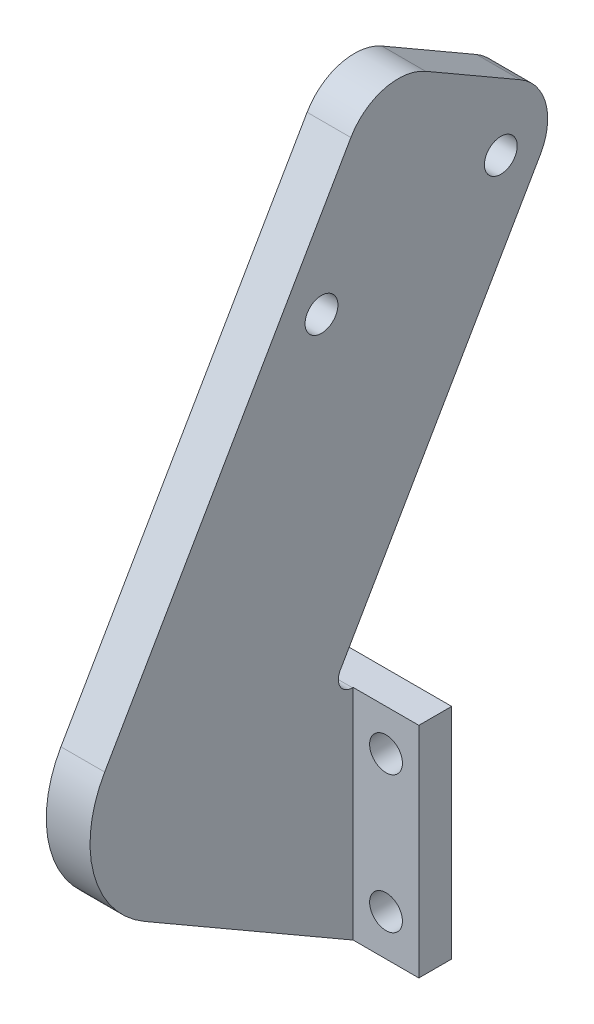
ISO-10303-21;
HEADER;
FILE_DESCRIPTION(('STEP AP214'),'2;1');
FILE_NAME('part.step','',(''),(''),'','','');
FILE_SCHEMA(('AUTOMOTIVE_DESIGN { 1 0 10303 214 1 1 1 1 }'));
ENDSEC;
DATA;
#1=APPLICATION_CONTEXT('core data for automotive mechanical design processes');
#2=APPLICATION_PROTOCOL_DEFINITION('international standard','automotive_design',2000,#1);
#3=PRODUCT_CONTEXT('',#1,'mechanical');
#4=PRODUCT('Part','Part','',(#3));
#5=PRODUCT_RELATED_PRODUCT_CATEGORY('part','',(#4));
#6=PRODUCT_DEFINITION_FORMATION('','',#4);
#7=PRODUCT_DEFINITION_CONTEXT('part definition',#1,'design');
#8=PRODUCT_DEFINITION('design','',#6,#7);
#9=PRODUCT_DEFINITION_SHAPE('','',#8);
#10=(LENGTH_UNIT() NAMED_UNIT(*) SI_UNIT(.MILLI.,.METRE.));
#11=(NAMED_UNIT(*) PLANE_ANGLE_UNIT() SI_UNIT($,.RADIAN.));
#12=(NAMED_UNIT(*) SI_UNIT($,.STERADIAN.) SOLID_ANGLE_UNIT());
#13=UNCERTAINTY_MEASURE_WITH_UNIT(LENGTH_MEASURE(1.E-05),#10,'distance_accuracy_value','');
#14=(GEOMETRIC_REPRESENTATION_CONTEXT(3) GLOBAL_UNCERTAINTY_ASSIGNED_CONTEXT((#13)) GLOBAL_UNIT_ASSIGNED_CONTEXT((#10,
#11,#12)) REPRESENTATION_CONTEXT('',''));
#15=CARTESIAN_POINT('',(0.,0.,0.));
#16=DIRECTION('',(0.,0.,1.));
#17=DIRECTION('',(1.,0.,0.));
#18=AXIS2_PLACEMENT_3D('',#15,#16,#17);
#19=CARTESIAN_POINT('',(0.,0.,0.));
#20=DIRECTION('',(0.,0.,-1.));
#21=DIRECTION('',(-1.,0.,0.));
#22=AXIS2_PLACEMENT_3D('',#19,#20,#21);
#23=PLANE('',#22);
#24=CARTESIAN_POINT('',(14.0000000000001,3.75,0.));
#25=DIRECTION('',(0.,0.,1.));
#26=DIRECTION('',(1.,0.,0.));
#27=AXIS2_PLACEMENT_3D('',#24,#25,#26);
#28=CIRCLE('',#27,1.5);
#29=CARTESIAN_POINT('',(15.5000000000001,3.75,0.));
#30=VERTEX_POINT('',#29);
#31=EDGE_CURVE('E149',#30,#30,#28,.T.);
#32=ORIENTED_EDGE('',*,*,#31,.T.);
#33=EDGE_LOOP('',(#32));
#34=FACE_BOUND('',#33,.T.);
#35=CARTESIAN_POINT('',(14.,16.25,0.));
#36=DIRECTION('',(0.,0.,1.));
#37=DIRECTION('',(1.,0.,0.));
#38=AXIS2_PLACEMENT_3D('',#35,#36,#37);
#39=CIRCLE('',#38,1.5);
#40=CARTESIAN_POINT('',(15.5,16.25,0.));
#41=VERTEX_POINT('',#40);
#42=EDGE_CURVE('E160',#41,#41,#39,.T.);
#43=ORIENTED_EDGE('',*,*,#42,.T.);
#44=EDGE_LOOP('',(#43));
#45=FACE_BOUND('',#44,.T.);
#46=DIRECTION('',(1.,0.,0.));
#47=VECTOR('',#46,1.);
#48=CARTESIAN_POINT('',(0.,0.,0.));
#49=LINE('',#48,#47);
#50=CARTESIAN_POINT('',(7.,0.,0.));
#51=VERTEX_POINT('',#50);
#52=CARTESIAN_POINT('',(17.,0.,0.));
#53=VERTEX_POINT('',#52);
#54=EDGE_CURVE('E165',#51,#53,#49,.T.);
#55=ORIENTED_EDGE('',*,*,#54,.F.);
#56=DIRECTION('',(0.,-1.,0.));
#57=VECTOR('',#56,1.);
#58=CARTESIAN_POINT('',(7.,20.,0.));
#59=LINE('',#58,#57);
#60=CARTESIAN_POINT('',(7.,20.,0.));
#61=VERTEX_POINT('',#60);
#62=EDGE_CURVE('E128',#61,#51,#59,.T.);
#63=ORIENTED_EDGE('',*,*,#62,.F.);
#64=DIRECTION('',(-1.,0.,0.));
#65=VECTOR('',#64,1.);
#66=CARTESIAN_POINT('',(0.,20.,0.));
#67=LINE('',#66,#65);
#68=CARTESIAN_POINT('',(17.,20.,0.));
#69=VERTEX_POINT('',#68);
#70=EDGE_CURVE('E170',#69,#61,#67,.T.);
#71=ORIENTED_EDGE('',*,*,#70,.F.);
#72=DIRECTION('',(0.,1.,0.));
#73=VECTOR('',#72,1.);
#74=CARTESIAN_POINT('',(17.,0.,0.));
#75=LINE('',#74,#73);
#76=EDGE_CURVE('E177',#53,#69,#75,.T.);
#77=ORIENTED_EDGE('',*,*,#76,.F.);
#78=EDGE_LOOP('',(#55,#63,#71,#77));
#79=FACE_BOUND('',#78,.T.);
#80=ADVANCED_FACE('F36',(#34,#45,#79),#23,.T.);
#81=CARTESIAN_POINT('',(0.,0.,3.));
#82=DIRECTION('',(0.,1.,0.));
#83=DIRECTION('',(0.,0.,1.));
#84=AXIS2_PLACEMENT_3D('',#81,#82,#83);
#85=PLANE('',#84);
#86=DIRECTION('',(0.,0.,1.));
#87=VECTOR('',#86,1.);
#88=CARTESIAN_POINT('',(7.,0.,0.));
#89=LINE('',#88,#87);
#90=CARTESIAN_POINT('',(7.,0.,3.));
#91=VERTEX_POINT('',#90);
#92=EDGE_CURVE('E125',#51,#91,#89,.T.);
#93=ORIENTED_EDGE('',*,*,#92,.F.);
#94=ORIENTED_EDGE('',*,*,#54,.T.);
#95=DIRECTION('',(0.,0.,-1.));
#96=VECTOR('',#95,1.);
#97=CARTESIAN_POINT('',(17.,0.,3.));
#98=LINE('',#97,#96);
#99=CARTESIAN_POINT('',(17.,0.,3.));
#100=VERTEX_POINT('',#99);
#101=EDGE_CURVE('E183',#100,#53,#98,.T.);
#102=ORIENTED_EDGE('',*,*,#101,.F.);
#103=DIRECTION('',(1.,0.,0.));
#104=VECTOR('',#103,1.);
#105=CARTESIAN_POINT('',(0.,0.,3.));
#106=LINE('',#105,#104);
#107=CARTESIAN_POINT('',(11.,0.,3.));
#108=VERTEX_POINT('',#107);
#109=EDGE_CURVE('E148',#108,#100,#106,.T.);
#110=ORIENTED_EDGE('',*,*,#109,.F.);
#111=DIRECTION('',(-1.,0.,0.));
#112=VECTOR('',#111,1.);
#113=CARTESIAN_POINT('',(11.,0.,3.));
#114=LINE('',#113,#112);
#115=EDGE_CURVE('E139',#108,#91,#114,.T.);
#116=ORIENTED_EDGE('',*,*,#115,.T.);
#117=EDGE_LOOP('',(#93,#94,#102,#110,#116));
#118=FACE_BOUND('',#117,.T.);
#119=ADVANCED_FACE('F146',(#118),#85,.F.);
#120=CARTESIAN_POINT('',(0.,20.,3.));
#121=DIRECTION('',(0.,-1.,0.));
#122=DIRECTION('',(0.,0.,-1.));
#123=AXIS2_PLACEMENT_3D('',#120,#121,#122);
#124=PLANE('',#123);
#125=DIRECTION('',(0.,0.,-1.));
#126=VECTOR('',#125,1.);
#127=CARTESIAN_POINT('',(7.,20.,3.05773502691893));
#128=LINE('',#127,#126);
#129=CARTESIAN_POINT('',(7.,20.,3.05773502691893));
#130=VERTEX_POINT('',#129);
#131=EDGE_CURVE('E228',#130,#61,#128,.T.);
#132=ORIENTED_EDGE('',*,*,#131,.F.);
#133=DIRECTION('',(-1.,0.,0.));
#134=VECTOR('',#133,1.);
#135=CARTESIAN_POINT('',(0.,20.,3.05773502691893));
#136=LINE('',#135,#134);
#137=CARTESIAN_POINT('',(11.,20.,3.05773502691893));
#138=VERTEX_POINT('',#137);
#139=EDGE_CURVE('E204',#130,#138,#136,.F.);
#140=ORIENTED_EDGE('',*,*,#139,.T.);
#141=DIRECTION('',(0.,0.,-1.));
#142=VECTOR('',#141,1.);
#143=CARTESIAN_POINT('',(11.,20.,3.));
#144=LINE('',#143,#142);
#145=CARTESIAN_POINT('',(11.,20.,3.));
#146=VERTEX_POINT('',#145);
#147=EDGE_CURVE('E150',#138,#146,#144,.T.);
#148=ORIENTED_EDGE('',*,*,#147,.T.);
#149=DIRECTION('',(-1.,0.,0.));
#150=VECTOR('',#149,1.);
#151=CARTESIAN_POINT('',(0.,20.,3.));
#152=LINE('',#151,#150);
#153=CARTESIAN_POINT('',(17.,20.,3.));
#154=VERTEX_POINT('',#153);
#155=EDGE_CURVE('E172',#154,#146,#152,.T.);
#156=ORIENTED_EDGE('',*,*,#155,.F.);
#157=DIRECTION('',(0.,0.,-1.));
#158=VECTOR('',#157,1.);
#159=CARTESIAN_POINT('',(17.,20.,3.));
#160=LINE('',#159,#158);
#161=EDGE_CURVE('E175',#154,#69,#160,.T.);
#162=ORIENTED_EDGE('',*,*,#161,.T.);
#163=ORIENTED_EDGE('',*,*,#70,.T.);
#164=EDGE_LOOP('',(#132,#140,#148,#156,#162,#163));
#165=FACE_BOUND('',#164,.T.);
#166=ADVANCED_FACE('F300',(#165),#124,.F.);
#167=CARTESIAN_POINT('',(11.,20.,5.30940107675847));
#168=DIRECTION('',(0.,-0.500000000000002,-0.866025403784438));
#169=DIRECTION('',(0.,0.866025403784438,-0.500000000000002));
#170=AXIS2_PLACEMENT_3D('',#167,#168,#169);
#171=PLANE('',#170);
#172=DIRECTION('',(-1.,0.,0.));
#173=VECTOR('',#172,1.);
#174=CARTESIAN_POINT('',(11.,21.95,4.1835680518387));
#175=LINE('',#174,#173);
#176=CARTESIAN_POINT('',(11.,21.95,4.1835680518387));
#177=VERTEX_POINT('',#176);
#178=CARTESIAN_POINT('',(7.,21.95,4.1835680518387));
#179=VERTEX_POINT('',#178);
#180=EDGE_CURVE('E201',#177,#179,#175,.T.);
#181=ORIENTED_EDGE('',*,*,#180,.T.);
#182=DIRECTION('',(0.,-0.866025403784438,0.500000000000001));
#183=VECTOR('',#182,1.);
#184=CARTESIAN_POINT('',(7.,53.6313972081441,-14.1076951545868));
#185=LINE('',#184,#183);
#186=CARTESIAN_POINT('',(7.,53.6313972081441,-14.1076951545868));
#187=VERTEX_POINT('',#186);
#188=EDGE_CURVE('E229',#187,#179,#185,.T.);
#189=ORIENTED_EDGE('',*,*,#188,.F.);
#190=DIRECTION('',(-1.,0.,0.));
#191=VECTOR('',#190,1.);
#192=CARTESIAN_POINT('',(11.,53.6313972081441,-14.1076951545868));
#193=LINE('',#192,#191);
#194=CARTESIAN_POINT('',(11.,53.6313972081441,-14.1076951545868));
#195=VERTEX_POINT('',#194);
#196=EDGE_CURVE('E199',#187,#195,#193,.F.);
#197=ORIENTED_EDGE('',*,*,#196,.T.);
#198=DIRECTION('',(0.,-0.866025403784438,0.500000000000002));
#199=VECTOR('',#198,1.);
#200=CARTESIAN_POINT('',(11.,20.,5.30940107675847));
#201=LINE('',#200,#199);
#202=EDGE_CURVE('E155',#195,#177,#201,.T.);
#203=ORIENTED_EDGE('',*,*,#202,.T.);
#204=EDGE_LOOP('',(#181,#189,#197,#203));
#205=FACE_BOUND('',#204,.T.);
#206=ADVANCED_FACE('F220',(#205),#171,.T.);
#207=CARTESIAN_POINT('',(11.,57.9615242270663,-16.6076951545868));
#208=DIRECTION('',(0.,0.866025403784438,-0.500000000000002));
#209=DIRECTION('',(0.,0.500000000000002,0.866025403784438));
#210=AXIS2_PLACEMENT_3D('',#207,#208,#209);
#211=PLANE('',#210);
#212=DIRECTION('',(-1.,0.,0.));
#213=VECTOR('',#212,1.);
#214=CARTESIAN_POINT('',(11.,60.4615242270663,-12.2775681356646));
#215=LINE('',#214,#213);
#216=CARTESIAN_POINT('',(11.,60.4615242270663,-12.2775681356646));
#217=VERTEX_POINT('',#216);
#218=CARTESIAN_POINT('',(7.,60.4615242270663,-12.2775681356646));
#219=VERTEX_POINT('',#218);
#220=EDGE_CURVE('E189',#217,#219,#215,.T.);
#221=ORIENTED_EDGE('',*,*,#220,.T.);
#222=DIRECTION('',(0.,-0.500000000000002,-0.866025403784438));
#223=VECTOR('',#222,1.);
#224=CARTESIAN_POINT('',(7.,65.4615242270663,-3.61731409782026));
#225=LINE('',#224,#223);
#226=CARTESIAN_POINT('',(7.,65.4615242270663,-3.61731409782026));
#227=VERTEX_POINT('',#226);
#228=EDGE_CURVE('E260',#227,#219,#225,.T.);
#229=ORIENTED_EDGE('',*,*,#228,.F.);
#230=DIRECTION('',(-1.,0.,0.));
#231=VECTOR('',#230,1.);
#232=CARTESIAN_POINT('',(11.,65.4615242270663,-3.61731409782026));
#233=LINE('',#232,#231);
#234=CARTESIAN_POINT('',(11.,65.4615242270663,-3.61731409782026));
#235=VERTEX_POINT('',#234);
#236=EDGE_CURVE('E192',#227,#235,#233,.F.);
#237=ORIENTED_EDGE('',*,*,#236,.T.);
#238=DIRECTION('',(0.,-0.500000000000002,-0.866025403784438));
#239=VECTOR('',#238,1.);
#240=CARTESIAN_POINT('',(11.,57.9615242270663,-16.6076951545868));
#241=LINE('',#240,#239);
#242=EDGE_CURVE('E223',#235,#217,#241,.T.);
#243=ORIENTED_EDGE('',*,*,#242,.T.);
#244=EDGE_LOOP('',(#221,#229,#237,#243));
#245=FACE_BOUND('',#244,.T.);
#246=ADVANCED_FACE('F253',(#245),#211,.T.);
#247=CARTESIAN_POINT('',(11.,67.9615242270663,0.712812921101924));
#248=DIRECTION('',(0.,0.500000000000001,0.866025403784438));
#249=DIRECTION('',(0.,-0.866025403784438,0.500000000000001));
#250=AXIS2_PLACEMENT_3D('',#247,#248,#249);
#251=PLANE('',#250);
#252=DIRECTION('',(-1.,0.,0.));
#253=VECTOR('',#252,1.);
#254=CARTESIAN_POINT('',(11.,63.6313972081441,3.21281292110193));
#255=LINE('',#254,#253);
#256=CARTESIAN_POINT('',(11.,63.6313972081441,3.21281292110193));
#257=VERTEX_POINT('',#256);
#258=CARTESIAN_POINT('',(7.,63.6313972081441,3.21281292110193));
#259=VERTEX_POINT('',#258);
#260=EDGE_CURVE('E186',#257,#259,#255,.T.);
#261=ORIENTED_EDGE('',*,*,#260,.T.);
#262=DIRECTION('',(0.,0.866025403784438,-0.500000000000001));
#263=VECTOR('',#262,1.);
#264=CARTESIAN_POINT('',(7.,24.6602540378444,25.712812921102));
#265=LINE('',#264,#263);
#266=CARTESIAN_POINT('',(7.,24.6602540378444,25.712812921102));
#267=VERTEX_POINT('',#266);
#268=EDGE_CURVE('E265',#267,#259,#265,.T.);
#269=ORIENTED_EDGE('',*,*,#268,.F.);
#270=DIRECTION('',(-1.,0.,0.));
#271=VECTOR('',#270,1.);
#272=CARTESIAN_POINT('',(11.,24.6602540378444,25.712812921102));
#273=LINE('',#272,#271);
#274=CARTESIAN_POINT('',(11.,24.6602540378444,25.712812921102));
#275=VERTEX_POINT('',#274);
#276=EDGE_CURVE('E44',#267,#275,#273,.F.);
#277=ORIENTED_EDGE('',*,*,#276,.T.);
#278=DIRECTION('',(0.,0.866025403784438,-0.500000000000001));
#279=VECTOR('',#278,1.);
#280=CARTESIAN_POINT('',(11.,67.9615242270663,0.712812921101924));
#281=LINE('',#280,#279);
#282=EDGE_CURVE('E247',#275,#257,#281,.T.);
#283=ORIENTED_EDGE('',*,*,#282,.T.);
#284=EDGE_LOOP('',(#261,#269,#277,#283));
#285=FACE_BOUND('',#284,.T.);
#286=ADVANCED_FACE('F327',(#285),#251,.T.);
#287=CARTESIAN_POINT('',(11.,16.,30.712812921102));
#288=DIRECTION('',(0.,-0.866025403784438,0.500000000000001));
#289=DIRECTION('',(0.,-0.500000000000001,-0.866025403784438));
#290=AXIS2_PLACEMENT_3D('',#287,#288,#289);
#291=PLANE('',#290);
#292=DIRECTION('',(-1.,0.,0.));
#293=VECTOR('',#292,1.);
#294=CARTESIAN_POINT('',(11.,11.,22.0525588832576));
#295=LINE('',#294,#293);
#296=CARTESIAN_POINT('',(11.,11.,22.0525588832576));
#297=VERTEX_POINT('',#296);
#298=CARTESIAN_POINT('',(7.,11.,22.0525588832576));
#299=VERTEX_POINT('',#298);
#300=EDGE_CURVE('E142',#297,#299,#295,.T.);
#301=ORIENTED_EDGE('',*,*,#300,.T.);
#302=DIRECTION('',(0.,0.500000000000002,0.866025403784438));
#303=VECTOR('',#302,1.);
#304=CARTESIAN_POINT('',(7.,0.,3.));
#305=LINE('',#304,#303);
#306=EDGE_CURVE('E51',#91,#299,#305,.T.);
#307=ORIENTED_EDGE('',*,*,#306,.F.);
#308=ORIENTED_EDGE('',*,*,#115,.F.);
#309=DIRECTION('',(0.,0.500000000000001,0.866025403784438));
#310=VECTOR('',#309,1.);
#311=CARTESIAN_POINT('',(11.,16.,30.712812921102));
#312=LINE('',#311,#310);
#313=EDGE_CURVE('E245',#108,#297,#312,.T.);
#314=ORIENTED_EDGE('',*,*,#313,.T.);
#315=EDGE_LOOP('',(#301,#307,#308,#314));
#316=FACE_BOUND('',#315,.T.);
#317=ADVANCED_FACE('F137',(#316),#291,.T.);
#318=CARTESIAN_POINT('',(6.,55.3715895870088,-10.493593539449));
#319=DIRECTION('',(1.,0.,0.));
#320=DIRECTION('',(0.,0.,-1.));
#321=AXIS2_PLACEMENT_3D('',#318,#319,#320);
#322=CYLINDRICAL_SURFACE('',#321,1.5);
#323=CARTESIAN_POINT('',(11.,55.3715895870088,-10.493593539449));
#324=DIRECTION('',(1.,0.,0.));
#325=DIRECTION('',(0.,0.,-1.));
#326=AXIS2_PLACEMENT_3D('',#323,#324,#325);
#327=CIRCLE('',#326,1.5);
#328=CARTESIAN_POINT('',(11.,55.3715895870088,-11.993593539449));
#329=VERTEX_POINT('',#328);
#330=EDGE_CURVE('E237',#329,#329,#327,.T.);
#331=ORIENTED_EDGE('',*,*,#330,.T.);
#332=EDGE_LOOP('',(#331));
#333=FACE_BOUND('',#332,.T.);
#334=CARTESIAN_POINT('',(7.,55.3715895870088,-10.493593539449));
#335=DIRECTION('',(-1.,0.,0.));
#336=DIRECTION('',(0.,0.,1.));
#337=AXIS2_PLACEMENT_3D('',#334,#335,#336);
#338=CIRCLE('',#337,1.5);
#339=CARTESIAN_POINT('',(7.,55.3715895870088,-8.99359353944901));
#340=VERTEX_POINT('',#339);
#341=EDGE_CURVE('E270',#340,#340,#338,.T.);
#342=ORIENTED_EDGE('',*,*,#341,.T.);
#343=EDGE_LOOP('',(#342));
#344=FACE_BOUND('',#343,.T.);
#345=ADVANCED_FACE('F274',(#333,#344),#322,.F.);
#346=CARTESIAN_POINT('',(6.,50.9792847415955,5.89871130596432));
#347=DIRECTION('',(1.,0.,0.));
#348=DIRECTION('',(0.,0.,-1.));
#349=AXIS2_PLACEMENT_3D('',#346,#347,#348);
#350=CYLINDRICAL_SURFACE('',#349,1.5);
#351=CARTESIAN_POINT('',(11.,50.9792847415955,5.89871130596432));
#352=DIRECTION('',(1.,0.,0.));
#353=DIRECTION('',(0.,0.,-1.));
#354=AXIS2_PLACEMENT_3D('',#351,#352,#353);
#355=CIRCLE('',#354,1.5);
#356=CARTESIAN_POINT('',(11.,50.9792847415955,4.39871130596432));
#357=VERTEX_POINT('',#356);
#358=EDGE_CURVE('E238',#357,#357,#355,.T.);
#359=ORIENTED_EDGE('',*,*,#358,.T.);
#360=EDGE_LOOP('',(#359));
#361=FACE_BOUND('',#360,.T.);
#362=CARTESIAN_POINT('',(7.,50.9792847415955,5.89871130596432));
#363=DIRECTION('',(-1.,0.,0.));
#364=DIRECTION('',(0.,0.,1.));
#365=AXIS2_PLACEMENT_3D('',#362,#363,#364);
#366=CIRCLE('',#365,1.5);
#367=CARTESIAN_POINT('',(7.,50.9792847415955,7.39871130596432));
#368=VERTEX_POINT('',#367);
#369=EDGE_CURVE('E132',#368,#368,#366,.T.);
#370=ORIENTED_EDGE('',*,*,#369,.T.);
#371=EDGE_LOOP('',(#370));
#372=FACE_BOUND('',#371,.T.);
#373=ADVANCED_FACE('F281',(#361,#372),#350,.F.);
#374=CARTESIAN_POINT('',(11.,61.1313972081441,-1.11731409782026));
#375=DIRECTION('',(-1.,0.,0.));
#376=DIRECTION('',(0.,0.,1.));
#377=AXIS2_PLACEMENT_3D('',#374,#375,#376);
#378=CYLINDRICAL_SURFACE('',#377,5.);
#379=ORIENTED_EDGE('',*,*,#236,.F.);
#380=CARTESIAN_POINT('',(7.,61.1313972081441,-1.11731409782026));
#381=DIRECTION('',(-1.,0.,0.));
#382=DIRECTION('',(0.,0.,1.));
#383=AXIS2_PLACEMENT_3D('',#380,#381,#382);
#384=CIRCLE('',#383,5.);
#385=EDGE_CURVE('E261',#259,#227,#384,.T.);
#386=ORIENTED_EDGE('',*,*,#385,.F.);
#387=ORIENTED_EDGE('',*,*,#260,.F.);
#388=CARTESIAN_POINT('',(11.,61.1313972081441,-1.11731409782026));
#389=DIRECTION('',(-1.,0.,0.));
#390=DIRECTION('',(0.,0.,1.));
#391=AXIS2_PLACEMENT_3D('',#388,#389,#390);
#392=CIRCLE('',#391,5.);
#393=EDGE_CURVE('E196',#235,#257,#392,.F.);
#394=ORIENTED_EDGE('',*,*,#393,.F.);
#395=EDGE_LOOP('',(#379,#386,#387,#394));
#396=FACE_BOUND('',#395,.T.);
#397=ADVANCED_FACE('F283',(#396),#378,.T.);
#398=CARTESIAN_POINT('',(11.,56.1313972081441,-9.77756813566464));
#399=DIRECTION('',(-1.,0.,0.));
#400=DIRECTION('',(0.,0.,1.));
#401=AXIS2_PLACEMENT_3D('',#398,#399,#400);
#402=CYLINDRICAL_SURFACE('',#401,5.);
#403=ORIENTED_EDGE('',*,*,#196,.F.);
#404=CARTESIAN_POINT('',(7.,56.1313972081441,-9.77756813566464));
#405=DIRECTION('',(-1.,0.,0.));
#406=DIRECTION('',(0.,0.,1.));
#407=AXIS2_PLACEMENT_3D('',#404,#405,#406);
#408=CIRCLE('',#407,5.);
#409=EDGE_CURVE('E232',#219,#187,#408,.T.);
#410=ORIENTED_EDGE('',*,*,#409,.F.);
#411=ORIENTED_EDGE('',*,*,#220,.F.);
#412=CARTESIAN_POINT('',(11.,56.1313972081441,-9.77756813566464));
#413=DIRECTION('',(-1.,0.,0.));
#414=DIRECTION('',(0.,0.,1.));
#415=AXIS2_PLACEMENT_3D('',#412,#413,#414);
#416=CIRCLE('',#415,5.);
#417=EDGE_CURVE('E194',#195,#217,#416,.F.);
#418=ORIENTED_EDGE('',*,*,#417,.F.);
#419=EDGE_LOOP('',(#403,#410,#411,#418));
#420=FACE_BOUND('',#419,.T.);
#421=ADVANCED_FACE('F259',(#420),#402,.T.);
#422=CARTESIAN_POINT('',(11.,21.3,3.05773502691893));
#423=DIRECTION('',(-1.,0.,0.));
#424=DIRECTION('',(0.,0.,1.));
#425=AXIS2_PLACEMENT_3D('',#422,#423,#424);
#426=CYLINDRICAL_SURFACE('',#425,1.3);
#427=CARTESIAN_POINT('',(7.,21.3,3.05773502691893));
#428=DIRECTION('',(1.,0.,0.));
#429=DIRECTION('',(0.,0.,1.));
#430=AXIS2_PLACEMENT_3D('',#427,#428,#429);
#431=CIRCLE('',#430,1.3);
#432=EDGE_CURVE('E226',#179,#130,#431,.T.);
#433=ORIENTED_EDGE('',*,*,#432,.F.);
#434=ORIENTED_EDGE('',*,*,#180,.F.);
#435=CARTESIAN_POINT('',(11.,21.3,3.05773502691893));
#436=DIRECTION('',(-1.,0.,0.));
#437=DIRECTION('',(0.,0.,1.));
#438=AXIS2_PLACEMENT_3D('',#435,#436,#437);
#439=CIRCLE('',#438,1.3);
#440=EDGE_CURVE('E206',#138,#177,#439,.T.);
#441=ORIENTED_EDGE('',*,*,#440,.F.);
#442=ORIENTED_EDGE('',*,*,#139,.F.);
#443=EDGE_LOOP('',(#433,#434,#441,#442));
#444=FACE_BOUND('',#443,.T.);
#445=ADVANCED_FACE('F225',(#444),#426,.F.);
#446=CARTESIAN_POINT('',(11.,19.6602540378444,17.0525588832576));
#447=DIRECTION('',(-1.,0.,0.));
#448=DIRECTION('',(0.,0.,1.));
#449=AXIS2_PLACEMENT_3D('',#446,#447,#448);
#450=CYLINDRICAL_SURFACE('',#449,10.);
#451=ORIENTED_EDGE('',*,*,#276,.F.);
#452=CARTESIAN_POINT('',(7.,19.6602540378444,17.0525588832576));
#453=DIRECTION('',(-1.,0.,0.));
#454=DIRECTION('',(0.,0.,1.));
#455=AXIS2_PLACEMENT_3D('',#452,#453,#454);
#456=CIRCLE('',#455,10.);
#457=EDGE_CURVE('E143',#299,#267,#456,.T.);
#458=ORIENTED_EDGE('',*,*,#457,.F.);
#459=ORIENTED_EDGE('',*,*,#300,.F.);
#460=CARTESIAN_POINT('',(11.,19.6602540378444,17.0525588832576));
#461=DIRECTION('',(-1.,0.,0.));
#462=DIRECTION('',(0.,0.,1.));
#463=AXIS2_PLACEMENT_3D('',#460,#461,#462);
#464=CIRCLE('',#463,10.);
#465=EDGE_CURVE('E11',#275,#297,#464,.F.);
#466=ORIENTED_EDGE('',*,*,#465,.F.);
#467=EDGE_LOOP('',(#451,#458,#459,#466));
#468=FACE_BOUND('',#467,.T.);
#469=ADVANCED_FACE('F38',(#468),#450,.T.);
#470=CARTESIAN_POINT('',(0.,0.,3.));
#471=DIRECTION('',(0.,0.,-1.));
#472=DIRECTION('',(-1.,0.,0.));
#473=AXIS2_PLACEMENT_3D('',#470,#471,#472);
#474=PLANE('',#473);
#475=CARTESIAN_POINT('',(14.,16.25,3.));
#476=DIRECTION('',(0.,0.,1.));
#477=DIRECTION('',(1.,0.,0.));
#478=AXIS2_PLACEMENT_3D('',#475,#476,#477);
#479=CIRCLE('',#478,1.5);
#480=CARTESIAN_POINT('',(15.5,16.25,3.));
#481=VERTEX_POINT('',#480);
#482=EDGE_CURVE('E162',#481,#481,#479,.T.);
#483=ORIENTED_EDGE('',*,*,#482,.F.);
#484=EDGE_LOOP('',(#483));
#485=FACE_BOUND('',#484,.T.);
#486=CARTESIAN_POINT('',(14.0000000000001,3.75,3.));
#487=DIRECTION('',(0.,0.,1.));
#488=DIRECTION('',(1.,0.,0.));
#489=AXIS2_PLACEMENT_3D('',#486,#487,#488);
#490=CIRCLE('',#489,1.5);
#491=CARTESIAN_POINT('',(15.5000000000001,3.75,3.));
#492=VERTEX_POINT('',#491);
#493=EDGE_CURVE('E153',#492,#492,#490,.T.);
#494=ORIENTED_EDGE('',*,*,#493,.F.);
#495=EDGE_LOOP('',(#494));
#496=FACE_BOUND('',#495,.T.);
#497=DIRECTION('',(0.,-1.,0.));
#498=VECTOR('',#497,1.);
#499=CARTESIAN_POINT('',(11.,20.,3.));
#500=LINE('',#499,#498);
#501=EDGE_CURVE('E241',#146,#108,#500,.T.);
#502=ORIENTED_EDGE('',*,*,#501,.T.);
#503=ORIENTED_EDGE('',*,*,#109,.T.);
#504=DIRECTION('',(0.,1.,0.));
#505=VECTOR('',#504,1.);
#506=CARTESIAN_POINT('',(17.,0.,3.));
#507=LINE('',#506,#505);
#508=EDGE_CURVE('E169',#100,#154,#507,.T.);
#509=ORIENTED_EDGE('',*,*,#508,.T.);
#510=ORIENTED_EDGE('',*,*,#155,.T.);
#511=EDGE_LOOP('',(#502,#503,#509,#510));
#512=FACE_BOUND('',#511,.T.);
#513=ADVANCED_FACE('F305',(#485,#496,#512),#474,.F.);
#514=CARTESIAN_POINT('',(17.,0.,3.));
#515=DIRECTION('',(-1.,0.,0.));
#516=DIRECTION('',(0.,0.,1.));
#517=AXIS2_PLACEMENT_3D('',#514,#515,#516);
#518=PLANE('',#517);
#519=ORIENTED_EDGE('',*,*,#76,.T.);
#520=ORIENTED_EDGE('',*,*,#161,.F.);
#521=ORIENTED_EDGE('',*,*,#508,.F.);
#522=ORIENTED_EDGE('',*,*,#101,.T.);
#523=EDGE_LOOP('',(#519,#520,#521,#522));
#524=FACE_BOUND('',#523,.T.);
#525=ADVANCED_FACE('F310',(#524),#518,.F.);
#526=CARTESIAN_POINT('',(14.,16.25,3.));
#527=DIRECTION('',(0.,0.,-1.));
#528=DIRECTION('',(-1.,0.,0.));
#529=AXIS2_PLACEMENT_3D('',#526,#527,#528);
#530=CYLINDRICAL_SURFACE('',#529,1.5);
#531=ORIENTED_EDGE('',*,*,#482,.T.);
#532=EDGE_LOOP('',(#531));
#533=FACE_BOUND('',#532,.T.);
#534=ORIENTED_EDGE('',*,*,#42,.F.);
#535=EDGE_LOOP('',(#534));
#536=FACE_BOUND('',#535,.T.);
#537=ADVANCED_FACE('F312',(#533,#536),#530,.F.);
#538=CARTESIAN_POINT('',(14.0000000000001,3.75,3.));
#539=DIRECTION('',(0.,0.,-1.));
#540=DIRECTION('',(-1.,0.,0.));
#541=AXIS2_PLACEMENT_3D('',#538,#539,#540);
#542=CYLINDRICAL_SURFACE('',#541,1.5);
#543=ORIENTED_EDGE('',*,*,#493,.T.);
#544=EDGE_LOOP('',(#543));
#545=FACE_BOUND('',#544,.T.);
#546=ORIENTED_EDGE('',*,*,#31,.F.);
#547=EDGE_LOOP('',(#546));
#548=FACE_BOUND('',#547,.T.);
#549=ADVANCED_FACE('F339',(#545,#548),#542,.F.);
#550=CARTESIAN_POINT('',(11.,0.,0.));
#551=DIRECTION('',(-1.,0.,0.));
#552=DIRECTION('',(0.,0.,1.));
#553=AXIS2_PLACEMENT_3D('',#550,#551,#552);
#554=PLANE('',#553);
#555=ORIENTED_EDGE('',*,*,#358,.F.);
#556=EDGE_LOOP('',(#555));
#557=FACE_BOUND('',#556,.T.);
#558=ORIENTED_EDGE('',*,*,#330,.F.);
#559=EDGE_LOOP('',(#558));
#560=FACE_BOUND('',#559,.T.);
#561=ORIENTED_EDGE('',*,*,#282,.F.);
#562=ORIENTED_EDGE('',*,*,#465,.T.);
#563=ORIENTED_EDGE('',*,*,#313,.F.);
#564=ORIENTED_EDGE('',*,*,#501,.F.);
#565=ORIENTED_EDGE('',*,*,#147,.F.);
#566=ORIENTED_EDGE('',*,*,#440,.T.);
#567=ORIENTED_EDGE('',*,*,#202,.F.);
#568=ORIENTED_EDGE('',*,*,#417,.T.);
#569=ORIENTED_EDGE('',*,*,#242,.F.);
#570=ORIENTED_EDGE('',*,*,#393,.T.);
#571=EDGE_LOOP('',(#561,#562,#563,#564,#565,#566,#567,#568,#569,#570));
#572=FACE_BOUND('',#571,.T.);
#573=ADVANCED_FACE('F213',(#557,#560,#572),#554,.F.);
#574=CARTESIAN_POINT('',(7.,19.6602540378444,17.0525588832576));
#575=DIRECTION('',(-1.,0.,0.));
#576=DIRECTION('',(0.,0.,1.));
#577=AXIS2_PLACEMENT_3D('',#574,#575,#576);
#578=PLANE('',#577);
#579=ORIENTED_EDGE('',*,*,#341,.F.);
#580=EDGE_LOOP('',(#579));
#581=FACE_BOUND('',#580,.T.);
#582=ORIENTED_EDGE('',*,*,#369,.F.);
#583=EDGE_LOOP('',(#582));
#584=FACE_BOUND('',#583,.T.);
#585=ORIENTED_EDGE('',*,*,#92,.T.);
#586=ORIENTED_EDGE('',*,*,#306,.T.);
#587=ORIENTED_EDGE('',*,*,#457,.T.);
#588=ORIENTED_EDGE('',*,*,#268,.T.);
#589=ORIENTED_EDGE('',*,*,#385,.T.);
#590=ORIENTED_EDGE('',*,*,#228,.T.);
#591=ORIENTED_EDGE('',*,*,#409,.T.);
#592=ORIENTED_EDGE('',*,*,#188,.T.);
#593=ORIENTED_EDGE('',*,*,#432,.T.);
#594=ORIENTED_EDGE('',*,*,#131,.T.);
#595=ORIENTED_EDGE('',*,*,#62,.T.);
#596=EDGE_LOOP('',(#585,#586,#587,#588,#589,#590,#591,#592,#593,#594,#595));
#597=FACE_BOUND('',#596,.T.);
#598=ADVANCED_FACE('F126',(#581,#584,#597),#578,.T.);
#599=CLOSED_SHELL('',(#80,#119,#166,#206,#246,#286,#317,#345,#373,#397,#421,#445,#469,#513,#525,
#537,#549,#573,#598));
#600=MANIFOLD_SOLID_BREP('B2',#599);
#601=ADVANCED_BREP_SHAPE_REPRESENTATION('',(#18,#600),#14);
#602=SHAPE_DEFINITION_REPRESENTATION(#9,#601);
ENDSEC;
END-ISO-10303-21;
